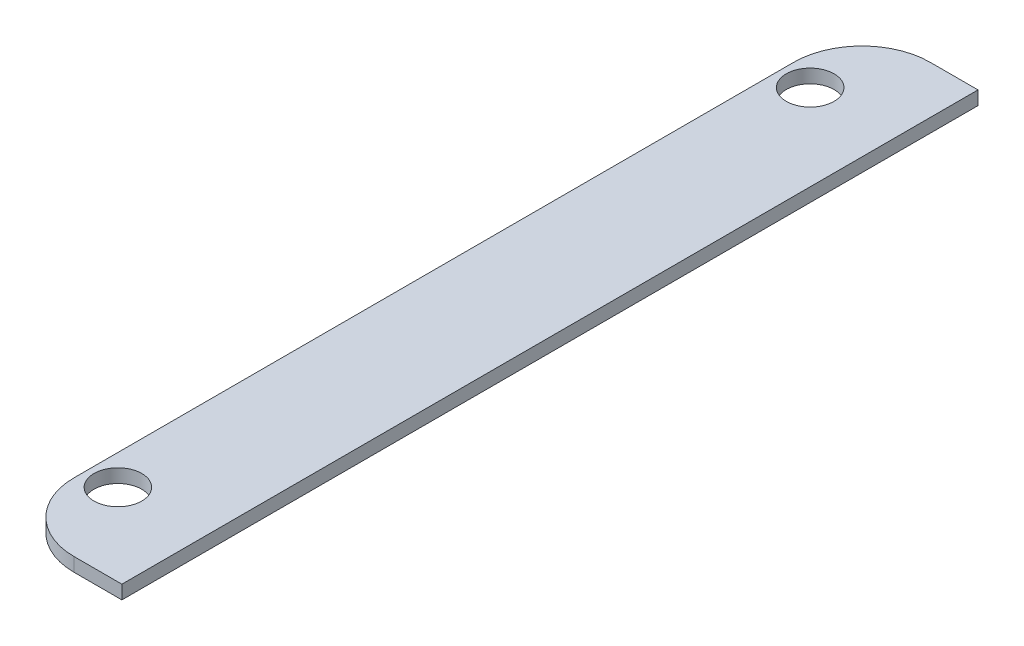
ISO-10303-21;
HEADER;
FILE_DESCRIPTION(('STEP AP214'),'2;1');
FILE_NAME('part.step','',(''),(''),'','','');
FILE_SCHEMA(('AUTOMOTIVE_DESIGN { 1 0 10303 214 1 1 1 1 }'));
ENDSEC;
DATA;
#1=APPLICATION_CONTEXT('core data for automotive mechanical design processes');
#2=APPLICATION_PROTOCOL_DEFINITION('international standard','automotive_design',2000,#1);
#3=PRODUCT_CONTEXT('',#1,'mechanical');
#4=PRODUCT('Part','Part','',(#3));
#5=PRODUCT_RELATED_PRODUCT_CATEGORY('part','',(#4));
#6=PRODUCT_DEFINITION_FORMATION('','',#4);
#7=PRODUCT_DEFINITION_CONTEXT('part definition',#1,'design');
#8=PRODUCT_DEFINITION('design','',#6,#7);
#9=PRODUCT_DEFINITION_SHAPE('','',#8);
#10=(LENGTH_UNIT() NAMED_UNIT(*) SI_UNIT(.MILLI.,.METRE.));
#11=(NAMED_UNIT(*) PLANE_ANGLE_UNIT() SI_UNIT($,.RADIAN.));
#12=(NAMED_UNIT(*) SI_UNIT($,.STERADIAN.) SOLID_ANGLE_UNIT());
#13=UNCERTAINTY_MEASURE_WITH_UNIT(LENGTH_MEASURE(1.E-05),#10,'distance_accuracy_value','');
#14=(GEOMETRIC_REPRESENTATION_CONTEXT(3) GLOBAL_UNCERTAINTY_ASSIGNED_CONTEXT((#13)) GLOBAL_UNIT_ASSIGNED_CONTEXT((#10,
#11,#12)) REPRESENTATION_CONTEXT('',''));
#15=CARTESIAN_POINT('',(0.,0.,0.));
#16=DIRECTION('',(0.,0.,1.));
#17=DIRECTION('',(1.,0.,0.));
#18=AXIS2_PLACEMENT_3D('',#15,#16,#17);
#19=CARTESIAN_POINT('',(0.,-2.,2.22044604925031E-13));
#20=DIRECTION('',(0.,-1.,0.));
#21=DIRECTION('',(1.,0.,0.));
#22=AXIS2_PLACEMENT_3D('',#19,#20,#21);
#23=PLANE('',#22);
#24=CARTESIAN_POINT('',(122.414038057746,-1.99999999999989,185.705554788375));
#25=DIRECTION('',(0.,-1.,0.));
#26=DIRECTION('',(1.,0.,0.));
#27=AXIS2_PLACEMENT_3D('',#24,#25,#26);
#28=CIRCLE('',#27,3.49999999999999);
#29=CARTESIAN_POINT('',(125.914038057746,-1.99999999999989,185.705554788375));
#30=VERTEX_POINT('',#29);
#31=EDGE_CURVE('E132',#30,#30,#28,.T.);
#32=ORIENTED_EDGE('',*,*,#31,.F.);
#33=EDGE_LOOP('',(#32));
#34=FACE_BOUND('',#33,.T.);
#35=DIRECTION('',(0.,0.,-1.));
#36=VECTOR('',#35,1.);
#37=CARTESIAN_POINT('',(118.,-1.99999999999989,197.705554788375));
#38=LINE('',#37,#36);
#39=CARTESIAN_POINT('',(117.999999999999,-1.99999999999995,187.705554788375));
#40=VERTEX_POINT('',#39);
#41=CARTESIAN_POINT('',(118.,-2.,82.2944452116276));
#42=VERTEX_POINT('',#41);
#43=EDGE_CURVE('E106',#40,#42,#38,.T.);
#44=ORIENTED_EDGE('',*,*,#43,.T.);
#45=CARTESIAN_POINT('',(128.,-2.,82.294445211628));
#46=DIRECTION('',(0.,-1.,0.));
#47=DIRECTION('',(1.,0.,0.));
#48=AXIS2_PLACEMENT_3D('',#45,#46,#47);
#49=CIRCLE('',#48,10.);
#50=CARTESIAN_POINT('',(128.,-2.00000000000003,72.294445211628));
#51=VERTEX_POINT('',#50);
#52=EDGE_CURVE('E49',#42,#51,#49,.T.);
#53=ORIENTED_EDGE('',*,*,#52,.T.);
#54=DIRECTION('',(1.,0.,0.));
#55=VECTOR('',#54,1.);
#56=CARTESIAN_POINT('',(117.999999999999,-2.00000000000003,72.2944452116278));
#57=LINE('',#56,#55);
#58=CARTESIAN_POINT('',(135.,-1.99999999999995,72.294445211628));
#59=VERTEX_POINT('',#58);
#60=EDGE_CURVE('E95',#51,#59,#57,.T.);
#61=ORIENTED_EDGE('',*,*,#60,.T.);
#62=DIRECTION('',(0.,0.,1.));
#63=VECTOR('',#62,1.);
#64=CARTESIAN_POINT('',(135.,-2.00000000000014,197.705554788375));
#65=LINE('',#64,#63);
#66=CARTESIAN_POINT('',(135.,-2.00000000000014,197.705554788375));
#67=VERTEX_POINT('',#66);
#68=EDGE_CURVE('E99',#59,#67,#65,.T.);
#69=ORIENTED_EDGE('',*,*,#68,.T.);
#70=DIRECTION('',(-1.,0.,0.));
#71=VECTOR('',#70,1.);
#72=CARTESIAN_POINT('',(118.,-1.99999999999989,197.705554788375));
#73=LINE('',#72,#71);
#74=CARTESIAN_POINT('',(128.,-2.00000000000014,197.705554788375));
#75=VERTEX_POINT('',#74);
#76=EDGE_CURVE('E122',#67,#75,#73,.T.);
#77=ORIENTED_EDGE('',*,*,#76,.T.);
#78=CARTESIAN_POINT('',(127.999999999999,-2.00000000000006,187.705554788375));
#79=DIRECTION('',(0.,-1.,0.));
#80=DIRECTION('',(1.,0.,0.));
#81=AXIS2_PLACEMENT_3D('',#78,#79,#80);
#82=CIRCLE('',#81,10.);
#83=EDGE_CURVE('E157',#75,#40,#82,.T.);
#84=ORIENTED_EDGE('',*,*,#83,.T.);
#85=EDGE_LOOP('',(#44,#53,#61,#69,#77,#84));
#86=FACE_BOUND('',#85,.T.);
#87=CARTESIAN_POINT('',(122.414038057745,-1.99999999999989,84.2944452116271));
#88=DIRECTION('',(0.,-1.,0.));
#89=DIRECTION('',(1.,0.,0.));
#90=AXIS2_PLACEMENT_3D('',#87,#88,#89);
#91=CIRCLE('',#90,3.49999999999998);
#92=CARTESIAN_POINT('',(125.914038057745,-1.99999999999989,84.2944452116271));
#93=VERTEX_POINT('',#92);
#94=EDGE_CURVE('E169',#93,#93,#91,.T.);
#95=ORIENTED_EDGE('',*,*,#94,.F.);
#96=EDGE_LOOP('',(#95));
#97=FACE_BOUND('',#96,.T.);
#98=ADVANCED_FACE('F40',(#34,#86,#97),#23,.T.);
#99=CARTESIAN_POINT('',(0.,0.,0.));
#100=DIRECTION('',(0.,-1.,0.));
#101=DIRECTION('',(1.,0.,0.));
#102=AXIS2_PLACEMENT_3D('',#99,#100,#101);
#103=PLANE('',#102);
#104=DIRECTION('',(1.,0.,0.));
#105=VECTOR('',#104,1.);
#106=CARTESIAN_POINT('',(117.999999999999,0.,72.2944452116275));
#107=LINE('',#106,#105);
#108=CARTESIAN_POINT('',(128.,0.,72.2944452116274));
#109=VERTEX_POINT('',#108);
#110=CARTESIAN_POINT('',(135.,0.,72.2944452116274));
#111=VERTEX_POINT('',#110);
#112=EDGE_CURVE('E112',#109,#111,#107,.T.);
#113=ORIENTED_EDGE('',*,*,#112,.F.);
#114=CARTESIAN_POINT('',(128.,0.,82.2944452116274));
#115=DIRECTION('',(0.,-1.,0.));
#116=DIRECTION('',(1.,0.,0.));
#117=AXIS2_PLACEMENT_3D('',#114,#115,#116);
#118=CIRCLE('',#117,10.);
#119=CARTESIAN_POINT('',(118.,0.,82.2944452116275));
#120=VERTEX_POINT('',#119);
#121=EDGE_CURVE('E148',#109,#120,#118,.F.);
#122=ORIENTED_EDGE('',*,*,#121,.T.);
#123=DIRECTION('',(0.,0.,-1.));
#124=VECTOR('',#123,1.);
#125=CARTESIAN_POINT('',(118.,1.11022302462516E-13,197.705554788375));
#126=LINE('',#125,#124);
#127=CARTESIAN_POINT('',(117.999999999999,2.22044604925031E-13,187.705554788375));
#128=VERTEX_POINT('',#127);
#129=EDGE_CURVE('E129',#128,#120,#126,.T.);
#130=ORIENTED_EDGE('',*,*,#129,.F.);
#131=CARTESIAN_POINT('',(127.999999999999,0.,187.705554788375));
#132=DIRECTION('',(0.,-1.,0.));
#133=DIRECTION('',(1.,0.,0.));
#134=AXIS2_PLACEMENT_3D('',#131,#132,#133);
#135=CIRCLE('',#134,10.);
#136=CARTESIAN_POINT('',(128.,-1.38777878078145E-13,197.705554788375));
#137=VERTEX_POINT('',#136);
#138=EDGE_CURVE('E145',#128,#137,#135,.F.);
#139=ORIENTED_EDGE('',*,*,#138,.T.);
#140=DIRECTION('',(-1.,0.,0.));
#141=VECTOR('',#140,1.);
#142=CARTESIAN_POINT('',(118.,1.11022302462516E-13,197.705554788375));
#143=LINE('',#142,#141);
#144=CARTESIAN_POINT('',(135.,-1.38777878078145E-13,197.705554788375));
#145=VERTEX_POINT('',#144);
#146=EDGE_CURVE('E138',#145,#137,#143,.T.);
#147=ORIENTED_EDGE('',*,*,#146,.F.);
#148=DIRECTION('',(0.,0.,1.));
#149=VECTOR('',#148,1.);
#150=CARTESIAN_POINT('',(135.,-1.38777878078145E-13,197.705554788375));
#151=LINE('',#150,#149);
#152=EDGE_CURVE('E135',#111,#145,#151,.T.);
#153=ORIENTED_EDGE('',*,*,#152,.F.);
#154=EDGE_LOOP('',(#113,#122,#130,#139,#147,#153));
#155=FACE_BOUND('',#154,.T.);
#156=CARTESIAN_POINT('',(122.414038057746,1.11022302462516E-13,185.705554788375));
#157=DIRECTION('',(0.,-1.,0.));
#158=DIRECTION('',(1.,0.,0.));
#159=AXIS2_PLACEMENT_3D('',#156,#157,#158);
#160=CIRCLE('',#159,3.49999999999999);
#161=CARTESIAN_POINT('',(125.914038057746,1.11665242032068E-13,185.705554788375));
#162=VERTEX_POINT('',#161);
#163=EDGE_CURVE('E174',#162,#162,#160,.T.);
#164=ORIENTED_EDGE('',*,*,#163,.T.);
#165=EDGE_LOOP('',(#164));
#166=FACE_BOUND('',#165,.T.);
#167=CARTESIAN_POINT('',(122.414038057745,1.11022302462516E-13,84.2944452116269));
#168=DIRECTION('',(0.,-1.,0.));
#169=DIRECTION('',(1.,0.,0.));
#170=AXIS2_PLACEMENT_3D('',#167,#168,#169);
#171=CIRCLE('',#170,3.49999999999998);
#172=CARTESIAN_POINT('',(125.914038057745,1.11665242032068E-13,84.2944452116269));
#173=VERTEX_POINT('',#172);
#174=EDGE_CURVE('E165',#173,#173,#171,.T.);
#175=ORIENTED_EDGE('',*,*,#174,.T.);
#176=EDGE_LOOP('',(#175));
#177=FACE_BOUND('',#176,.T.);
#178=ADVANCED_FACE('F185',(#155,#166,#177),#103,.F.);
#179=CARTESIAN_POINT('',(118.,-1.99999999999989,197.705554788375));
#180=DIRECTION('',(1.,0.,0.));
#181=DIRECTION('',(0.,1.,0.));
#182=AXIS2_PLACEMENT_3D('',#179,#180,#181);
#183=PLANE('',#182);
#184=ORIENTED_EDGE('',*,*,#129,.T.);
#185=DIRECTION('',(0.,1.,0.));
#186=VECTOR('',#185,1.);
#187=CARTESIAN_POINT('',(118.,-2.,82.2944452116276));
#188=LINE('',#187,#186);
#189=EDGE_CURVE('E62',#120,#42,#188,.F.);
#190=ORIENTED_EDGE('',*,*,#189,.T.);
#191=ORIENTED_EDGE('',*,*,#43,.F.);
#192=DIRECTION('',(0.,1.,0.));
#193=VECTOR('',#192,1.);
#194=CARTESIAN_POINT('',(117.999999999999,-1.99999999999995,187.705554788375));
#195=LINE('',#194,#193);
#196=EDGE_CURVE('E151',#40,#128,#195,.T.);
#197=ORIENTED_EDGE('',*,*,#196,.T.);
#198=EDGE_LOOP('',(#184,#190,#191,#197));
#199=FACE_BOUND('',#198,.T.);
#200=ADVANCED_FACE('F208',(#199),#183,.F.);
#201=CARTESIAN_POINT('',(117.999999999999,-2.00000000000003,72.2944452116278));
#202=DIRECTION('',(0.,0.,1.));
#203=DIRECTION('',(1.,0.,0.));
#204=AXIS2_PLACEMENT_3D('',#201,#202,#203);
#205=PLANE('',#204);
#206=ORIENTED_EDGE('',*,*,#60,.F.);
#207=DIRECTION('',(0.,1.,0.));
#208=VECTOR('',#207,1.);
#209=CARTESIAN_POINT('',(128.,-2.00000000000003,72.294445211628));
#210=LINE('',#209,#208);
#211=EDGE_CURVE('E116',#51,#109,#210,.T.);
#212=ORIENTED_EDGE('',*,*,#211,.T.);
#213=ORIENTED_EDGE('',*,*,#112,.T.);
#214=DIRECTION('',(0.,1.,0.));
#215=VECTOR('',#214,1.);
#216=CARTESIAN_POINT('',(135.,-1.99999999999995,72.294445211628));
#217=LINE('',#216,#215);
#218=EDGE_CURVE('E109',#59,#111,#217,.T.);
#219=ORIENTED_EDGE('',*,*,#218,.F.);
#220=EDGE_LOOP('',(#206,#212,#213,#219));
#221=FACE_BOUND('',#220,.T.);
#222=ADVANCED_FACE('F110',(#221),#205,.F.);
#223=CARTESIAN_POINT('',(135.,-2.00000000000014,197.705554788375));
#224=DIRECTION('',(-1.,0.,0.));
#225=DIRECTION('',(0.,-1.,0.));
#226=AXIS2_PLACEMENT_3D('',#223,#224,#225);
#227=PLANE('',#226);
#228=ORIENTED_EDGE('',*,*,#152,.T.);
#229=DIRECTION('',(0.,1.,0.));
#230=VECTOR('',#229,1.);
#231=CARTESIAN_POINT('',(135.,-2.00000000000014,197.705554788375));
#232=LINE('',#231,#230);
#233=EDGE_CURVE('E117',#67,#145,#232,.T.);
#234=ORIENTED_EDGE('',*,*,#233,.F.);
#235=ORIENTED_EDGE('',*,*,#68,.F.);
#236=ORIENTED_EDGE('',*,*,#218,.T.);
#237=EDGE_LOOP('',(#228,#234,#235,#236));
#238=FACE_BOUND('',#237,.T.);
#239=ADVANCED_FACE('F119',(#238),#227,.F.);
#240=CARTESIAN_POINT('',(118.,-1.99999999999989,197.705554788375));
#241=DIRECTION('',(0.,0.,-1.));
#242=DIRECTION('',(-1.,0.,0.));
#243=AXIS2_PLACEMENT_3D('',#240,#241,#242);
#244=PLANE('',#243);
#245=ORIENTED_EDGE('',*,*,#146,.T.);
#246=DIRECTION('',(0.,1.,0.));
#247=VECTOR('',#246,1.);
#248=CARTESIAN_POINT('',(128.,-2.00000000000014,197.705554788375));
#249=LINE('',#248,#247);
#250=EDGE_CURVE('E11',#137,#75,#249,.F.);
#251=ORIENTED_EDGE('',*,*,#250,.T.);
#252=ORIENTED_EDGE('',*,*,#76,.F.);
#253=ORIENTED_EDGE('',*,*,#233,.T.);
#254=EDGE_LOOP('',(#245,#251,#252,#253));
#255=FACE_BOUND('',#254,.T.);
#256=ADVANCED_FACE('F191',(#255),#244,.F.);
#257=CARTESIAN_POINT('',(122.414038057746,-1.99999999999989,185.705554788375));
#258=DIRECTION('',(0.,1.,0.));
#259=DIRECTION('',(-1.,0.,0.));
#260=AXIS2_PLACEMENT_3D('',#257,#258,#259);
#261=CYLINDRICAL_SURFACE('',#260,3.49999999999999);
#262=ORIENTED_EDGE('',*,*,#31,.T.);
#263=EDGE_LOOP('',(#262));
#264=FACE_BOUND('',#263,.T.);
#265=ORIENTED_EDGE('',*,*,#163,.F.);
#266=EDGE_LOOP('',(#265));
#267=FACE_BOUND('',#266,.T.);
#268=ADVANCED_FACE('F188',(#264,#267),#261,.F.);
#269=CARTESIAN_POINT('',(122.414038057745,-1.99999999999989,84.2944452116271));
#270=DIRECTION('',(0.,1.,0.));
#271=DIRECTION('',(-1.,0.,0.));
#272=AXIS2_PLACEMENT_3D('',#269,#270,#271);
#273=CYLINDRICAL_SURFACE('',#272,3.49999999999998);
#274=ORIENTED_EDGE('',*,*,#94,.T.);
#275=EDGE_LOOP('',(#274));
#276=FACE_BOUND('',#275,.T.);
#277=ORIENTED_EDGE('',*,*,#174,.F.);
#278=EDGE_LOOP('',(#277));
#279=FACE_BOUND('',#278,.T.);
#280=ADVANCED_FACE('F190',(#276,#279),#273,.F.);
#281=CARTESIAN_POINT('',(128.,-2.,82.294445211628));
#282=DIRECTION('',(0.,1.,0.));
#283=DIRECTION('',(-1.,0.,0.));
#284=AXIS2_PLACEMENT_3D('',#281,#282,#283);
#285=CYLINDRICAL_SURFACE('',#284,10.);
#286=ORIENTED_EDGE('',*,*,#52,.F.);
#287=ORIENTED_EDGE('',*,*,#189,.F.);
#288=ORIENTED_EDGE('',*,*,#121,.F.);
#289=ORIENTED_EDGE('',*,*,#211,.F.);
#290=EDGE_LOOP('',(#286,#287,#288,#289));
#291=FACE_BOUND('',#290,.T.);
#292=ADVANCED_FACE('F198',(#291),#285,.T.);
#293=CARTESIAN_POINT('',(127.999999999999,-2.00000000000006,187.705554788375));
#294=DIRECTION('',(0.,1.,0.));
#295=DIRECTION('',(-1.,0.,0.));
#296=AXIS2_PLACEMENT_3D('',#293,#294,#295);
#297=CYLINDRICAL_SURFACE('',#296,10.);
#298=ORIENTED_EDGE('',*,*,#83,.F.);
#299=ORIENTED_EDGE('',*,*,#250,.F.);
#300=ORIENTED_EDGE('',*,*,#138,.F.);
#301=ORIENTED_EDGE('',*,*,#196,.F.);
#302=EDGE_LOOP('',(#298,#299,#300,#301));
#303=FACE_BOUND('',#302,.T.);
#304=ADVANCED_FACE('F42',(#303),#297,.T.);
#305=CLOSED_SHELL('',(#98,#178,#200,#222,#239,#256,#268,#280,#292,#304));
#306=MANIFOLD_SOLID_BREP('B2',#305);
#307=ADVANCED_BREP_SHAPE_REPRESENTATION('',(#18,#306),#14);
#308=SHAPE_DEFINITION_REPRESENTATION(#9,#307);
ENDSEC;
END-ISO-10303-21;
